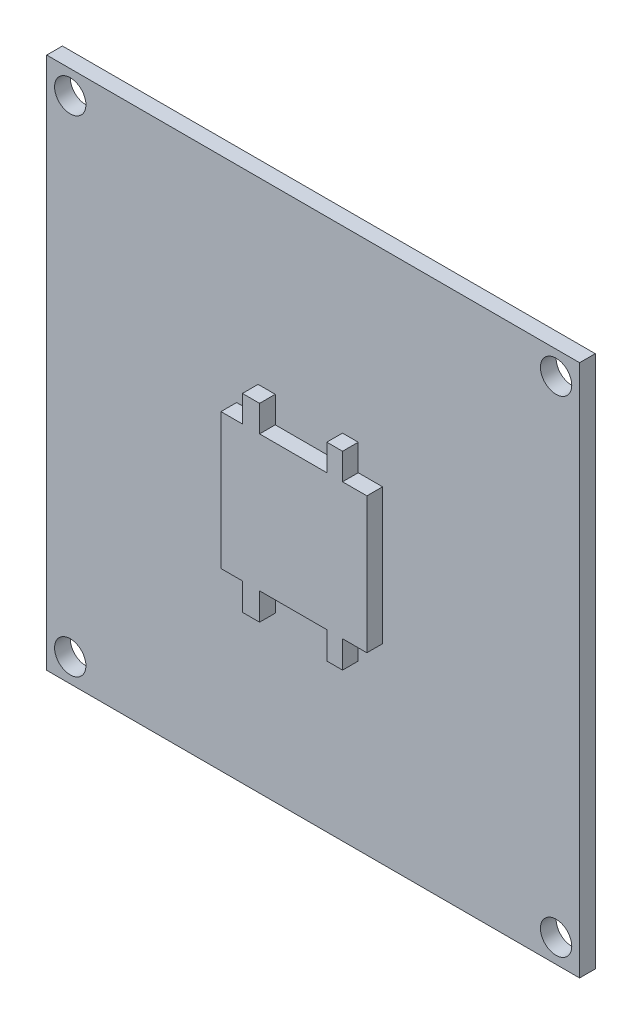
ISO-10303-21;
HEADER;
FILE_DESCRIPTION(('STEP AP214'),'2;1');
FILE_NAME('part.step','',(''),(''),'','','');
FILE_SCHEMA(('AUTOMOTIVE_DESIGN { 1 0 10303 214 1 1 1 1 }'));
ENDSEC;
DATA;
#1=APPLICATION_CONTEXT('core data for automotive mechanical design processes');
#2=APPLICATION_PROTOCOL_DEFINITION('international standard','automotive_design',2000,#1);
#3=PRODUCT_CONTEXT('',#1,'mechanical');
#4=PRODUCT('Part','Part','',(#3));
#5=PRODUCT_RELATED_PRODUCT_CATEGORY('part','',(#4));
#6=PRODUCT_DEFINITION_FORMATION('','',#4);
#7=PRODUCT_DEFINITION_CONTEXT('part definition',#1,'design');
#8=PRODUCT_DEFINITION('design','',#6,#7);
#9=PRODUCT_DEFINITION_SHAPE('','',#8);
#10=(LENGTH_UNIT() NAMED_UNIT(*) SI_UNIT(.MILLI.,.METRE.));
#11=(NAMED_UNIT(*) PLANE_ANGLE_UNIT() SI_UNIT($,.RADIAN.));
#12=(NAMED_UNIT(*) SI_UNIT($,.STERADIAN.) SOLID_ANGLE_UNIT());
#13=UNCERTAINTY_MEASURE_WITH_UNIT(LENGTH_MEASURE(1.E-05),#10,'distance_accuracy_value','');
#14=(GEOMETRIC_REPRESENTATION_CONTEXT(3) GLOBAL_UNCERTAINTY_ASSIGNED_CONTEXT((#13)) GLOBAL_UNIT_ASSIGNED_CONTEXT((#10,
#11,#12)) REPRESENTATION_CONTEXT('',''));
#15=CARTESIAN_POINT('',(0.,0.,0.));
#16=DIRECTION('',(0.,0.,1.));
#17=DIRECTION('',(1.,0.,0.));
#18=AXIS2_PLACEMENT_3D('',#15,#16,#17);
#19=CARTESIAN_POINT('',(0.,0.,1.));
#20=DIRECTION('',(0.,0.,-1.));
#21=DIRECTION('',(-1.,0.,0.));
#22=AXIS2_PLACEMENT_3D('',#19,#20,#21);
#23=PLANE('',#22);
#24=CARTESIAN_POINT('',(32.5,1.5,1.));
#25=DIRECTION('',(0.,0.,1.));
#26=DIRECTION('',(1.,0.,0.));
#27=AXIS2_PLACEMENT_3D('',#24,#25,#26);
#28=CIRCLE('',#27,0.999999999999998);
#29=CARTESIAN_POINT('',(33.5,1.5,1.));
#30=VERTEX_POINT('',#29);
#31=EDGE_CURVE('E238',#30,#30,#28,.T.);
#32=ORIENTED_EDGE('',*,*,#31,.F.);
#33=EDGE_LOOP('',(#32));
#34=FACE_BOUND('',#33,.T.);
#35=CARTESIAN_POINT('',(1.5,1.5,1.));
#36=DIRECTION('',(0.,0.,1.));
#37=DIRECTION('',(1.,0.,0.));
#38=AXIS2_PLACEMENT_3D('',#35,#36,#37);
#39=CIRCLE('',#38,1.);
#40=CARTESIAN_POINT('',(2.5,1.5,1.));
#41=VERTEX_POINT('',#40);
#42=EDGE_CURVE('E247',#41,#41,#39,.T.);
#43=ORIENTED_EDGE('',*,*,#42,.F.);
#44=EDGE_LOOP('',(#43));
#45=FACE_BOUND('',#44,.T.);
#46=CARTESIAN_POINT('',(32.5,32.5,1.));
#47=DIRECTION('',(0.,0.,1.));
#48=DIRECTION('',(1.,0.,0.));
#49=AXIS2_PLACEMENT_3D('',#46,#47,#48);
#50=CIRCLE('',#49,0.999999999999998);
#51=CARTESIAN_POINT('',(33.5,32.5,1.));
#52=VERTEX_POINT('',#51);
#53=EDGE_CURVE('E253',#52,#52,#50,.T.);
#54=ORIENTED_EDGE('',*,*,#53,.F.);
#55=EDGE_LOOP('',(#54));
#56=FACE_BOUND('',#55,.T.);
#57=CARTESIAN_POINT('',(1.5,32.5,1.));
#58=DIRECTION('',(0.,0.,1.));
#59=DIRECTION('',(1.,0.,0.));
#60=AXIS2_PLACEMENT_3D('',#57,#58,#59);
#61=CIRCLE('',#60,1.);
#62=CARTESIAN_POINT('',(2.5,32.5,1.));
#63=VERTEX_POINT('',#62);
#64=EDGE_CURVE('E259',#63,#63,#61,.T.);
#65=ORIENTED_EDGE('',*,*,#64,.F.);
#66=EDGE_LOOP('',(#65));
#67=FACE_BOUND('',#66,.T.);
#68=DIRECTION('',(0.,-1.,0.));
#69=VECTOR('',#68,1.);
#70=CARTESIAN_POINT('',(0.,0.,1.));
#71=LINE('',#70,#69);
#72=CARTESIAN_POINT('',(0.,34.,1.));
#73=VERTEX_POINT('',#72);
#74=CARTESIAN_POINT('',(0.,0.,1.));
#75=VERTEX_POINT('',#74);
#76=EDGE_CURVE('E265',#73,#75,#71,.T.);
#77=ORIENTED_EDGE('',*,*,#76,.T.);
#78=DIRECTION('',(1.,0.,0.));
#79=VECTOR('',#78,1.);
#80=CARTESIAN_POINT('',(0.,0.,1.));
#81=LINE('',#80,#79);
#82=CARTESIAN_POINT('',(34.,0.,1.));
#83=VERTEX_POINT('',#82);
#84=EDGE_CURVE('E89',#75,#83,#81,.T.);
#85=ORIENTED_EDGE('',*,*,#84,.T.);
#86=DIRECTION('',(0.,1.,0.));
#87=VECTOR('',#86,1.);
#88=CARTESIAN_POINT('',(34.,0.,1.));
#89=LINE('',#88,#87);
#90=CARTESIAN_POINT('',(34.,34.,1.));
#91=VERTEX_POINT('',#90);
#92=EDGE_CURVE('E268',#83,#91,#89,.T.);
#93=ORIENTED_EDGE('',*,*,#92,.T.);
#94=DIRECTION('',(-1.,0.,0.));
#95=VECTOR('',#94,1.);
#96=CARTESIAN_POINT('',(0.,34.,1.));
#97=LINE('',#96,#95);
#98=EDGE_CURVE('E61',#91,#73,#97,.T.);
#99=ORIENTED_EDGE('',*,*,#98,.T.);
#100=EDGE_LOOP('',(#77,#85,#93,#99));
#101=FACE_BOUND('',#100,.T.);
#102=DIRECTION('',(-1.,0.,0.));
#103=VECTOR('',#102,1.);
#104=CARTESIAN_POINT('',(0.,20.8566450376839,1.));
#105=LINE('',#104,#103);
#106=CARTESIAN_POINT('',(21.427154658643,20.8566450376839,1.));
#107=VERTEX_POINT('',#106);
#108=CARTESIAN_POINT('',(19.8753684896341,20.8566450376839,1.));
#109=VERTEX_POINT('',#108);
#110=EDGE_CURVE('E233',#107,#109,#105,.T.);
#111=ORIENTED_EDGE('',*,*,#110,.F.);
#112=DIRECTION('',(0.,-1.,0.));
#113=VECTOR('',#112,1.);
#114=CARTESIAN_POINT('',(21.427154658643,0.,1.));
#115=LINE('',#114,#113);
#116=CARTESIAN_POINT('',(21.427154658643,12.1848987991048,1.));
#117=VERTEX_POINT('',#116);
#118=EDGE_CURVE('E227',#107,#117,#115,.T.);
#119=ORIENTED_EDGE('',*,*,#118,.T.);
#120=DIRECTION('',(-1.,0.,0.));
#121=VECTOR('',#120,1.);
#122=CARTESIAN_POINT('',(0.,12.1848987991048,1.));
#123=LINE('',#122,#121);
#124=CARTESIAN_POINT('',(19.8753684896341,12.1848987991048,1.));
#125=VERTEX_POINT('',#124);
#126=EDGE_CURVE('E52',#117,#125,#123,.T.);
#127=ORIENTED_EDGE('',*,*,#126,.T.);
#128=DIRECTION('',(0.,-1.,0.));
#129=VECTOR('',#128,1.);
#130=CARTESIAN_POINT('',(19.8753684896341,0.,1.));
#131=LINE('',#130,#129);
#132=CARTESIAN_POINT('',(19.8753684896341,10.450549551389,1.));
#133=VERTEX_POINT('',#132);
#134=EDGE_CURVE('E685',#125,#133,#131,.T.);
#135=ORIENTED_EDGE('',*,*,#134,.T.);
#136=DIRECTION('',(1.,0.,0.));
#137=VECTOR('',#136,1.);
#138=CARTESIAN_POINT('',(0.,10.450549551389,1.));
#139=LINE('',#138,#137);
#140=CARTESIAN_POINT('',(18.871271556746,10.450549551389,1.));
#141=VERTEX_POINT('',#140);
#142=EDGE_CURVE('E682',#141,#133,#139,.T.);
#143=ORIENTED_EDGE('',*,*,#142,.F.);
#144=DIRECTION('',(0.,-1.,0.));
#145=VECTOR('',#144,1.);
#146=CARTESIAN_POINT('',(18.871271556746,0.,1.));
#147=LINE('',#146,#145);
#148=CARTESIAN_POINT('',(18.871271556746,12.1848987991048,1.));
#149=VERTEX_POINT('',#148);
#150=EDGE_CURVE('E680',#149,#141,#147,.T.);
#151=ORIENTED_EDGE('',*,*,#150,.F.);
#152=CARTESIAN_POINT('',(14.5810392071332,12.1848987991048,1.));
#153=VERTEX_POINT('',#152);
#154=EDGE_CURVE('E672',#149,#153,#123,.T.);
#155=ORIENTED_EDGE('',*,*,#154,.T.);
#156=DIRECTION('',(0.,-1.,0.));
#157=VECTOR('',#156,1.);
#158=CARTESIAN_POINT('',(14.5810392071332,0.,1.));
#159=LINE('',#158,#157);
#160=CARTESIAN_POINT('',(14.5810392071332,10.450549551389,1.));
#161=VERTEX_POINT('',#160);
#162=EDGE_CURVE('E677',#153,#161,#159,.T.);
#163=ORIENTED_EDGE('',*,*,#162,.T.);
#164=DIRECTION('',(1.,0.,0.));
#165=VECTOR('',#164,1.);
#166=CARTESIAN_POINT('',(0.,10.450549551389,1.));
#167=LINE('',#166,#165);
#168=CARTESIAN_POINT('',(13.4856607348916,10.450549551389,1.));
#169=VERTEX_POINT('',#168);
#170=EDGE_CURVE('E674',#169,#161,#167,.T.);
#171=ORIENTED_EDGE('',*,*,#170,.F.);
#172=DIRECTION('',(0.,-1.,0.));
#173=VECTOR('',#172,1.);
#174=CARTESIAN_POINT('',(13.4856607348916,0.,1.));
#175=LINE('',#174,#173);
#176=CARTESIAN_POINT('',(13.4856607348916,12.1848987991048,1.));
#177=VERTEX_POINT('',#176);
#178=EDGE_CURVE('E671',#177,#169,#175,.T.);
#179=ORIENTED_EDGE('',*,*,#178,.F.);
#180=CARTESIAN_POINT('',(12.1164376445897,12.1848987991048,1.));
#181=VERTEX_POINT('',#180);
#182=EDGE_CURVE('E668',#177,#181,#123,.T.);
#183=ORIENTED_EDGE('',*,*,#182,.T.);
#184=DIRECTION('',(0.,-1.,0.));
#185=VECTOR('',#184,1.);
#186=CARTESIAN_POINT('',(12.1164376445897,0.,1.));
#187=LINE('',#186,#185);
#188=CARTESIAN_POINT('',(12.1164376445897,20.8566450376839,1.));
#189=VERTEX_POINT('',#188);
#190=EDGE_CURVE('E665',#189,#181,#187,.T.);
#191=ORIENTED_EDGE('',*,*,#190,.F.);
#192=CARTESIAN_POINT('',(13.4856607348916,20.8566450376839,1.));
#193=VERTEX_POINT('',#192);
#194=EDGE_CURVE('E648',#193,#189,#105,.T.);
#195=ORIENTED_EDGE('',*,*,#194,.F.);
#196=DIRECTION('',(0.,1.,0.));
#197=VECTOR('',#196,1.);
#198=CARTESIAN_POINT('',(13.4856607348916,0.,1.));
#199=LINE('',#198,#197);
#200=CARTESIAN_POINT('',(13.4856607348916,22.5453535157229,1.));
#201=VERTEX_POINT('',#200);
#202=EDGE_CURVE('E659',#193,#201,#199,.T.);
#203=ORIENTED_EDGE('',*,*,#202,.T.);
#204=DIRECTION('',(1.,0.,0.));
#205=VECTOR('',#204,1.);
#206=CARTESIAN_POINT('',(0.,22.5453535157229,1.));
#207=LINE('',#206,#205);
#208=CARTESIAN_POINT('',(14.5810392071332,22.5453535157229,1.));
#209=VERTEX_POINT('',#208);
#210=EDGE_CURVE('E657',#201,#209,#207,.T.);
#211=ORIENTED_EDGE('',*,*,#210,.T.);
#212=DIRECTION('',(0.,1.,0.));
#213=VECTOR('',#212,1.);
#214=CARTESIAN_POINT('',(14.5810392071332,0.,1.));
#215=LINE('',#214,#213);
#216=CARTESIAN_POINT('',(14.5810392071332,20.8566450376839,1.));
#217=VERTEX_POINT('',#216);
#218=EDGE_CURVE('E645',#217,#209,#215,.T.);
#219=ORIENTED_EDGE('',*,*,#218,.F.);
#220=CARTESIAN_POINT('',(18.871271556746,20.8566450376839,1.));
#221=VERTEX_POINT('',#220);
#222=EDGE_CURVE('E635',#221,#217,#105,.T.);
#223=ORIENTED_EDGE('',*,*,#222,.F.);
#224=DIRECTION('',(0.,1.,0.));
#225=VECTOR('',#224,1.);
#226=CARTESIAN_POINT('',(18.871271556746,0.,1.));
#227=LINE('',#226,#225);
#228=CARTESIAN_POINT('',(18.871271556746,22.5453535157229,1.));
#229=VERTEX_POINT('',#228);
#230=EDGE_CURVE('E646',#221,#229,#227,.T.);
#231=ORIENTED_EDGE('',*,*,#230,.T.);
#232=DIRECTION('',(1.,0.,0.));
#233=VECTOR('',#232,1.);
#234=CARTESIAN_POINT('',(0.,22.5453535157229,1.));
#235=LINE('',#234,#233);
#236=CARTESIAN_POINT('',(19.8753684896341,22.5453535157229,1.));
#237=VERTEX_POINT('',#236);
#238=EDGE_CURVE('E727',#229,#237,#235,.T.);
#239=ORIENTED_EDGE('',*,*,#238,.T.);
#240=DIRECTION('',(0.,1.,0.));
#241=VECTOR('',#240,1.);
#242=CARTESIAN_POINT('',(19.8753684896341,0.,1.));
#243=LINE('',#242,#241);
#244=EDGE_CURVE('E728',#109,#237,#243,.T.);
#245=ORIENTED_EDGE('',*,*,#244,.F.);
#246=EDGE_LOOP('',(#111,#119,#127,#135,#143,#151,#155,#163,#171,#179,#183,#191,#195,#203,#211,
#219,#223,#231,#239,#245));
#247=FACE_BOUND('',#246,.T.);
#248=ADVANCED_FACE('F37',(#34,#45,#56,#67,#101,#247),#23,.F.);
#249=CARTESIAN_POINT('',(0.,0.,0.));
#250=DIRECTION('',(0.,0.,-1.));
#251=DIRECTION('',(-1.,0.,0.));
#252=AXIS2_PLACEMENT_3D('',#249,#250,#251);
#253=PLANE('',#252);
#254=CARTESIAN_POINT('',(1.5,1.5,0.));
#255=DIRECTION('',(0.,0.,1.));
#256=DIRECTION('',(1.,0.,0.));
#257=AXIS2_PLACEMENT_3D('',#254,#255,#256);
#258=CIRCLE('',#257,1.);
#259=CARTESIAN_POINT('',(2.5,1.5,0.));
#260=VERTEX_POINT('',#259);
#261=EDGE_CURVE('E245',#260,#260,#258,.T.);
#262=ORIENTED_EDGE('',*,*,#261,.T.);
#263=EDGE_LOOP('',(#262));
#264=FACE_BOUND('',#263,.T.);
#265=CARTESIAN_POINT('',(1.5,32.5,0.));
#266=DIRECTION('',(0.,0.,1.));
#267=DIRECTION('',(1.,0.,0.));
#268=AXIS2_PLACEMENT_3D('',#265,#266,#267);
#269=CIRCLE('',#268,1.);
#270=CARTESIAN_POINT('',(2.5,32.5,0.));
#271=VERTEX_POINT('',#270);
#272=EDGE_CURVE('E256',#271,#271,#269,.T.);
#273=ORIENTED_EDGE('',*,*,#272,.T.);
#274=EDGE_LOOP('',(#273));
#275=FACE_BOUND('',#274,.T.);
#276=DIRECTION('',(0.,-1.,0.));
#277=VECTOR('',#276,1.);
#278=CARTESIAN_POINT('',(0.,0.,0.));
#279=LINE('',#278,#277);
#280=CARTESIAN_POINT('',(0.,34.,0.));
#281=VERTEX_POINT('',#280);
#282=CARTESIAN_POINT('',(0.,0.,0.));
#283=VERTEX_POINT('',#282);
#284=EDGE_CURVE('E262',#281,#283,#279,.T.);
#285=ORIENTED_EDGE('',*,*,#284,.F.);
#286=DIRECTION('',(-1.,0.,0.));
#287=VECTOR('',#286,1.);
#288=CARTESIAN_POINT('',(0.,34.,0.));
#289=LINE('',#288,#287);
#290=CARTESIAN_POINT('',(34.,34.,0.));
#291=VERTEX_POINT('',#290);
#292=EDGE_CURVE('E82',#291,#281,#289,.T.);
#293=ORIENTED_EDGE('',*,*,#292,.F.);
#294=DIRECTION('',(0.,1.,0.));
#295=VECTOR('',#294,1.);
#296=CARTESIAN_POINT('',(34.,0.,0.));
#297=LINE('',#296,#295);
#298=CARTESIAN_POINT('',(34.,0.,0.));
#299=VERTEX_POINT('',#298);
#300=EDGE_CURVE('E276',#299,#291,#297,.T.);
#301=ORIENTED_EDGE('',*,*,#300,.F.);
#302=DIRECTION('',(1.,0.,0.));
#303=VECTOR('',#302,1.);
#304=CARTESIAN_POINT('',(0.,0.,0.));
#305=LINE('',#304,#303);
#306=EDGE_CURVE('E274',#283,#299,#305,.T.);
#307=ORIENTED_EDGE('',*,*,#306,.F.);
#308=EDGE_LOOP('',(#285,#293,#301,#307));
#309=FACE_BOUND('',#308,.T.);
#310=CARTESIAN_POINT('',(32.5,32.5,0.));
#311=DIRECTION('',(0.,0.,1.));
#312=DIRECTION('',(1.,0.,0.));
#313=AXIS2_PLACEMENT_3D('',#310,#311,#312);
#314=CIRCLE('',#313,0.999999999999998);
#315=CARTESIAN_POINT('',(33.5,32.5,0.));
#316=VERTEX_POINT('',#315);
#317=EDGE_CURVE('E250',#316,#316,#314,.T.);
#318=ORIENTED_EDGE('',*,*,#317,.T.);
#319=EDGE_LOOP('',(#318));
#320=FACE_BOUND('',#319,.T.);
#321=CARTESIAN_POINT('',(32.5,1.5,0.));
#322=DIRECTION('',(0.,0.,1.));
#323=DIRECTION('',(1.,0.,0.));
#324=AXIS2_PLACEMENT_3D('',#321,#322,#323);
#325=CIRCLE('',#324,0.999999999999998);
#326=CARTESIAN_POINT('',(33.5,1.5,0.));
#327=VERTEX_POINT('',#326);
#328=EDGE_CURVE('E235',#327,#327,#325,.T.);
#329=ORIENTED_EDGE('',*,*,#328,.T.);
#330=EDGE_LOOP('',(#329));
#331=FACE_BOUND('',#330,.T.);
#332=ADVANCED_FACE('F289',(#264,#275,#309,#320,#331),#253,.T.);
#333=CARTESIAN_POINT('',(0.,0.,1.));
#334=DIRECTION('',(1.,0.,0.));
#335=DIRECTION('',(0.,0.,-1.));
#336=AXIS2_PLACEMENT_3D('',#333,#334,#335);
#337=PLANE('',#336);
#338=ORIENTED_EDGE('',*,*,#284,.T.);
#339=DIRECTION('',(0.,0.,-1.));
#340=VECTOR('',#339,1.);
#341=CARTESIAN_POINT('',(0.,0.,1.));
#342=LINE('',#341,#340);
#343=EDGE_CURVE('E11',#75,#283,#342,.T.);
#344=ORIENTED_EDGE('',*,*,#343,.F.);
#345=ORIENTED_EDGE('',*,*,#76,.F.);
#346=DIRECTION('',(0.,0.,-1.));
#347=VECTOR('',#346,1.);
#348=CARTESIAN_POINT('',(0.,34.,1.));
#349=LINE('',#348,#347);
#350=EDGE_CURVE('E271',#73,#281,#349,.T.);
#351=ORIENTED_EDGE('',*,*,#350,.T.);
#352=EDGE_LOOP('',(#338,#344,#345,#351));
#353=FACE_BOUND('',#352,.T.);
#354=ADVANCED_FACE('F39',(#353),#337,.F.);
#355=CARTESIAN_POINT('',(0.,0.,1.));
#356=DIRECTION('',(0.,1.,0.));
#357=DIRECTION('',(0.,0.,1.));
#358=AXIS2_PLACEMENT_3D('',#355,#356,#357);
#359=PLANE('',#358);
#360=ORIENTED_EDGE('',*,*,#306,.T.);
#361=DIRECTION('',(0.,0.,-1.));
#362=VECTOR('',#361,1.);
#363=CARTESIAN_POINT('',(34.,0.,1.));
#364=LINE('',#363,#362);
#365=EDGE_CURVE('E45',#83,#299,#364,.T.);
#366=ORIENTED_EDGE('',*,*,#365,.F.);
#367=ORIENTED_EDGE('',*,*,#84,.F.);
#368=ORIENTED_EDGE('',*,*,#343,.T.);
#369=EDGE_LOOP('',(#360,#366,#367,#368));
#370=FACE_BOUND('',#369,.T.);
#371=ADVANCED_FACE('F305',(#370),#359,.F.);
#372=CARTESIAN_POINT('',(34.,0.,1.));
#373=DIRECTION('',(-1.,0.,0.));
#374=DIRECTION('',(0.,0.,1.));
#375=AXIS2_PLACEMENT_3D('',#372,#373,#374);
#376=PLANE('',#375);
#377=ORIENTED_EDGE('',*,*,#300,.T.);
#378=DIRECTION('',(0.,0.,-1.));
#379=VECTOR('',#378,1.);
#380=CARTESIAN_POINT('',(34.,34.,1.));
#381=LINE('',#380,#379);
#382=EDGE_CURVE('E280',#91,#291,#381,.T.);
#383=ORIENTED_EDGE('',*,*,#382,.F.);
#384=ORIENTED_EDGE('',*,*,#92,.F.);
#385=ORIENTED_EDGE('',*,*,#365,.T.);
#386=EDGE_LOOP('',(#377,#383,#384,#385));
#387=FACE_BOUND('',#386,.T.);
#388=ADVANCED_FACE('F285',(#387),#376,.F.);
#389=CARTESIAN_POINT('',(0.,34.,1.));
#390=DIRECTION('',(0.,-1.,0.));
#391=DIRECTION('',(0.,0.,-1.));
#392=AXIS2_PLACEMENT_3D('',#389,#390,#391);
#393=PLANE('',#392);
#394=ORIENTED_EDGE('',*,*,#292,.T.);
#395=ORIENTED_EDGE('',*,*,#350,.F.);
#396=ORIENTED_EDGE('',*,*,#98,.F.);
#397=ORIENTED_EDGE('',*,*,#382,.T.);
#398=EDGE_LOOP('',(#394,#395,#396,#397));
#399=FACE_BOUND('',#398,.T.);
#400=ADVANCED_FACE('F294',(#399),#393,.F.);
#401=CARTESIAN_POINT('',(1.5,32.5,1.));
#402=DIRECTION('',(0.,0.,-1.));
#403=DIRECTION('',(-1.,0.,0.));
#404=AXIS2_PLACEMENT_3D('',#401,#402,#403);
#405=CYLINDRICAL_SURFACE('',#404,1.);
#406=ORIENTED_EDGE('',*,*,#64,.T.);
#407=EDGE_LOOP('',(#406));
#408=FACE_BOUND('',#407,.T.);
#409=ORIENTED_EDGE('',*,*,#272,.F.);
#410=EDGE_LOOP('',(#409));
#411=FACE_BOUND('',#410,.T.);
#412=ADVANCED_FACE('F296',(#408,#411),#405,.F.);
#413=CARTESIAN_POINT('',(32.5,32.5,1.));
#414=DIRECTION('',(0.,0.,-1.));
#415=DIRECTION('',(-1.,0.,0.));
#416=AXIS2_PLACEMENT_3D('',#413,#414,#415);
#417=CYLINDRICAL_SURFACE('',#416,0.999999999999998);
#418=ORIENTED_EDGE('',*,*,#53,.T.);
#419=EDGE_LOOP('',(#418));
#420=FACE_BOUND('',#419,.T.);
#421=ORIENTED_EDGE('',*,*,#317,.F.);
#422=EDGE_LOOP('',(#421));
#423=FACE_BOUND('',#422,.T.);
#424=ADVANCED_FACE('F302',(#420,#423),#417,.F.);
#425=CARTESIAN_POINT('',(1.5,1.5,1.));
#426=DIRECTION('',(0.,0.,-1.));
#427=DIRECTION('',(-1.,0.,0.));
#428=AXIS2_PLACEMENT_3D('',#425,#426,#427);
#429=CYLINDRICAL_SURFACE('',#428,1.);
#430=ORIENTED_EDGE('',*,*,#42,.T.);
#431=EDGE_LOOP('',(#430));
#432=FACE_BOUND('',#431,.T.);
#433=ORIENTED_EDGE('',*,*,#261,.F.);
#434=EDGE_LOOP('',(#433));
#435=FACE_BOUND('',#434,.T.);
#436=ADVANCED_FACE('F320',(#432,#435),#429,.F.);
#437=CARTESIAN_POINT('',(32.5,1.5,1.));
#438=DIRECTION('',(0.,0.,-1.));
#439=DIRECTION('',(-1.,0.,0.));
#440=AXIS2_PLACEMENT_3D('',#437,#438,#439);
#441=CYLINDRICAL_SURFACE('',#440,0.999999999999998);
#442=ORIENTED_EDGE('',*,*,#31,.T.);
#443=EDGE_LOOP('',(#442));
#444=FACE_BOUND('',#443,.T.);
#445=ORIENTED_EDGE('',*,*,#328,.F.);
#446=EDGE_LOOP('',(#445));
#447=FACE_BOUND('',#446,.T.);
#448=ADVANCED_FACE('F324',(#444,#447),#441,.F.);
#449=CARTESIAN_POINT('',(0.,20.8566450376839,2.));
#450=DIRECTION('',(0.,-1.,0.));
#451=DIRECTION('',(0.,0.,-1.));
#452=AXIS2_PLACEMENT_3D('',#449,#450,#451);
#453=PLANE('',#452);
#454=ORIENTED_EDGE('',*,*,#110,.T.);
#455=DIRECTION('',(0.,0.,-1.));
#456=VECTOR('',#455,1.);
#457=CARTESIAN_POINT('',(19.8753684896341,20.8566450376839,2.));
#458=LINE('',#457,#456);
#459=CARTESIAN_POINT('',(19.8753684896341,20.8566450376839,2.));
#460=VERTEX_POINT('',#459);
#461=EDGE_CURVE('E211',#460,#109,#458,.T.);
#462=ORIENTED_EDGE('',*,*,#461,.F.);
#463=DIRECTION('',(-1.,0.,0.));
#464=VECTOR('',#463,1.);
#465=CARTESIAN_POINT('',(0.,20.8566450376839,2.));
#466=LINE('',#465,#464);
#467=CARTESIAN_POINT('',(21.427154658643,20.8566450376839,2.));
#468=VERTEX_POINT('',#467);
#469=EDGE_CURVE('E218',#468,#460,#466,.T.);
#470=ORIENTED_EDGE('',*,*,#469,.F.);
#471=DIRECTION('',(0.,0.,-1.));
#472=VECTOR('',#471,1.);
#473=CARTESIAN_POINT('',(21.427154658643,20.8566450376839,2.));
#474=LINE('',#473,#472);
#475=EDGE_CURVE('E690',#468,#107,#474,.T.);
#476=ORIENTED_EDGE('',*,*,#475,.T.);
#477=EDGE_LOOP('',(#454,#462,#470,#476));
#478=FACE_BOUND('',#477,.T.);
#479=ADVANCED_FACE('F231',(#478),#453,.F.);
#480=CARTESIAN_POINT('',(19.8753684896341,0.,2.));
#481=DIRECTION('',(-1.,0.,0.));
#482=DIRECTION('',(0.,0.,1.));
#483=AXIS2_PLACEMENT_3D('',#480,#481,#482);
#484=PLANE('',#483);
#485=ORIENTED_EDGE('',*,*,#244,.T.);
#486=DIRECTION('',(0.,0.,-1.));
#487=VECTOR('',#486,1.);
#488=CARTESIAN_POINT('',(19.8753684896341,22.5453535157229,2.));
#489=LINE('',#488,#487);
#490=CARTESIAN_POINT('',(19.8753684896341,22.5453535157229,2.));
#491=VERTEX_POINT('',#490);
#492=EDGE_CURVE('E213',#491,#237,#489,.T.);
#493=ORIENTED_EDGE('',*,*,#492,.F.);
#494=DIRECTION('',(0.,1.,0.));
#495=VECTOR('',#494,1.);
#496=CARTESIAN_POINT('',(19.8753684896341,0.,2.));
#497=LINE('',#496,#495);
#498=EDGE_CURVE('E206',#460,#491,#497,.T.);
#499=ORIENTED_EDGE('',*,*,#498,.F.);
#500=ORIENTED_EDGE('',*,*,#461,.T.);
#501=EDGE_LOOP('',(#485,#493,#499,#500));
#502=FACE_BOUND('',#501,.T.);
#503=ADVANCED_FACE('F209',(#502),#484,.F.);
#504=CARTESIAN_POINT('',(0.,22.5453535157229,2.));
#505=DIRECTION('',(0.,1.,0.));
#506=DIRECTION('',(0.,0.,1.));
#507=AXIS2_PLACEMENT_3D('',#504,#505,#506);
#508=PLANE('',#507);
#509=ORIENTED_EDGE('',*,*,#238,.F.);
#510=DIRECTION('',(0.,0.,-1.));
#511=VECTOR('',#510,1.);
#512=CARTESIAN_POINT('',(18.871271556746,22.5453535157229,2.));
#513=LINE('',#512,#511);
#514=CARTESIAN_POINT('',(18.871271556746,22.5453535157229,2.));
#515=VERTEX_POINT('',#514);
#516=EDGE_CURVE('E240',#515,#229,#513,.T.);
#517=ORIENTED_EDGE('',*,*,#516,.F.);
#518=DIRECTION('',(1.,0.,0.));
#519=VECTOR('',#518,1.);
#520=CARTESIAN_POINT('',(0.,22.5453535157229,2.));
#521=LINE('',#520,#519);
#522=EDGE_CURVE('E217',#515,#491,#521,.T.);
#523=ORIENTED_EDGE('',*,*,#522,.T.);
#524=ORIENTED_EDGE('',*,*,#492,.T.);
#525=EDGE_LOOP('',(#509,#517,#523,#524));
#526=FACE_BOUND('',#525,.T.);
#527=ADVANCED_FACE('F331',(#526),#508,.T.);
#528=CARTESIAN_POINT('',(18.871271556746,0.,2.));
#529=DIRECTION('',(-1.,0.,0.));
#530=DIRECTION('',(0.,0.,1.));
#531=AXIS2_PLACEMENT_3D('',#528,#529,#530);
#532=PLANE('',#531);
#533=ORIENTED_EDGE('',*,*,#230,.F.);
#534=DIRECTION('',(0.,0.,-1.));
#535=VECTOR('',#534,1.);
#536=CARTESIAN_POINT('',(18.871271556746,20.8566450376839,2.));
#537=LINE('',#536,#535);
#538=CARTESIAN_POINT('',(18.871271556746,20.8566450376839,2.));
#539=VERTEX_POINT('',#538);
#540=EDGE_CURVE('E640',#539,#221,#537,.T.);
#541=ORIENTED_EDGE('',*,*,#540,.F.);
#542=DIRECTION('',(0.,1.,0.));
#543=VECTOR('',#542,1.);
#544=CARTESIAN_POINT('',(18.871271556746,0.,2.));
#545=LINE('',#544,#543);
#546=EDGE_CURVE('E725',#539,#515,#545,.T.);
#547=ORIENTED_EDGE('',*,*,#546,.T.);
#548=ORIENTED_EDGE('',*,*,#516,.T.);
#549=EDGE_LOOP('',(#533,#541,#547,#548));
#550=FACE_BOUND('',#549,.T.);
#551=ADVANCED_FACE('F334',(#550),#532,.T.);
#552=ORIENTED_EDGE('',*,*,#222,.T.);
#553=DIRECTION('',(0.,0.,-1.));
#554=VECTOR('',#553,1.);
#555=CARTESIAN_POINT('',(14.5810392071332,20.8566450376839,2.));
#556=LINE('',#555,#554);
#557=CARTESIAN_POINT('',(14.5810392071332,20.8566450376839,2.));
#558=VERTEX_POINT('',#557);
#559=EDGE_CURVE('E638',#558,#217,#556,.T.);
#560=ORIENTED_EDGE('',*,*,#559,.F.);
#561=EDGE_CURVE('E230',#539,#558,#466,.T.);
#562=ORIENTED_EDGE('',*,*,#561,.F.);
#563=ORIENTED_EDGE('',*,*,#540,.T.);
#564=EDGE_LOOP('',(#552,#560,#562,#563));
#565=FACE_BOUND('',#564,.T.);
#566=ADVANCED_FACE('F338',(#565),#453,.F.);
#567=CARTESIAN_POINT('',(14.5810392071332,0.,2.));
#568=DIRECTION('',(-1.,0.,0.));
#569=DIRECTION('',(0.,0.,1.));
#570=AXIS2_PLACEMENT_3D('',#567,#568,#569);
#571=PLANE('',#570);
#572=ORIENTED_EDGE('',*,*,#218,.T.);
#573=DIRECTION('',(0.,0.,-1.));
#574=VECTOR('',#573,1.);
#575=CARTESIAN_POINT('',(14.5810392071332,22.5453535157229,2.));
#576=LINE('',#575,#574);
#577=CARTESIAN_POINT('',(14.5810392071332,22.5453535157229,2.));
#578=VERTEX_POINT('',#577);
#579=EDGE_CURVE('E653',#578,#209,#576,.T.);
#580=ORIENTED_EDGE('',*,*,#579,.F.);
#581=DIRECTION('',(0.,1.,0.));
#582=VECTOR('',#581,1.);
#583=CARTESIAN_POINT('',(14.5810392071332,0.,2.));
#584=LINE('',#583,#582);
#585=EDGE_CURVE('E652',#558,#578,#584,.T.);
#586=ORIENTED_EDGE('',*,*,#585,.F.);
#587=ORIENTED_EDGE('',*,*,#559,.T.);
#588=EDGE_LOOP('',(#572,#580,#586,#587));
#589=FACE_BOUND('',#588,.T.);
#590=ADVANCED_FACE('F340',(#589),#571,.F.);
#591=CARTESIAN_POINT('',(0.,22.5453535157229,2.));
#592=DIRECTION('',(0.,1.,0.));
#593=DIRECTION('',(0.,0.,1.));
#594=AXIS2_PLACEMENT_3D('',#591,#592,#593);
#595=PLANE('',#594);
#596=ORIENTED_EDGE('',*,*,#210,.F.);
#597=DIRECTION('',(0.,0.,-1.));
#598=VECTOR('',#597,1.);
#599=CARTESIAN_POINT('',(13.4856607348916,22.5453535157229,2.));
#600=LINE('',#599,#598);
#601=CARTESIAN_POINT('',(13.4856607348916,22.5453535157229,2.));
#602=VERTEX_POINT('',#601);
#603=EDGE_CURVE('E719',#602,#201,#600,.T.);
#604=ORIENTED_EDGE('',*,*,#603,.F.);
#605=DIRECTION('',(1.,0.,0.));
#606=VECTOR('',#605,1.);
#607=CARTESIAN_POINT('',(0.,22.5453535157229,2.));
#608=LINE('',#607,#606);
#609=EDGE_CURVE('E756',#602,#578,#608,.T.);
#610=ORIENTED_EDGE('',*,*,#609,.T.);
#611=ORIENTED_EDGE('',*,*,#579,.T.);
#612=EDGE_LOOP('',(#596,#604,#610,#611));
#613=FACE_BOUND('',#612,.T.);
#614=ADVANCED_FACE('F343',(#613),#595,.T.);
#615=CARTESIAN_POINT('',(13.4856607348916,0.,2.));
#616=DIRECTION('',(-1.,0.,0.));
#617=DIRECTION('',(0.,0.,1.));
#618=AXIS2_PLACEMENT_3D('',#615,#616,#617);
#619=PLANE('',#618);
#620=ORIENTED_EDGE('',*,*,#202,.F.);
#621=DIRECTION('',(0.,0.,-1.));
#622=VECTOR('',#621,1.);
#623=CARTESIAN_POINT('',(13.4856607348916,20.8566450376839,2.));
#624=LINE('',#623,#622);
#625=CARTESIAN_POINT('',(13.4856607348916,20.8566450376839,2.));
#626=VERTEX_POINT('',#625);
#627=EDGE_CURVE('E717',#626,#193,#624,.T.);
#628=ORIENTED_EDGE('',*,*,#627,.F.);
#629=DIRECTION('',(0.,1.,0.));
#630=VECTOR('',#629,1.);
#631=CARTESIAN_POINT('',(13.4856607348916,0.,2.));
#632=LINE('',#631,#630);
#633=EDGE_CURVE('E753',#626,#602,#632,.T.);
#634=ORIENTED_EDGE('',*,*,#633,.T.);
#635=ORIENTED_EDGE('',*,*,#603,.T.);
#636=EDGE_LOOP('',(#620,#628,#634,#635));
#637=FACE_BOUND('',#636,.T.);
#638=ADVANCED_FACE('F347',(#637),#619,.T.);
#639=ORIENTED_EDGE('',*,*,#194,.T.);
#640=DIRECTION('',(0.,0.,-1.));
#641=VECTOR('',#640,1.);
#642=CARTESIAN_POINT('',(12.1164376445897,20.8566450376839,2.));
#643=LINE('',#642,#641);
#644=CARTESIAN_POINT('',(12.1164376445897,20.8566450376839,2.));
#645=VERTEX_POINT('',#644);
#646=EDGE_CURVE('E714',#645,#189,#643,.T.);
#647=ORIENTED_EDGE('',*,*,#646,.F.);
#648=EDGE_CURVE('E229',#626,#645,#466,.T.);
#649=ORIENTED_EDGE('',*,*,#648,.F.);
#650=ORIENTED_EDGE('',*,*,#627,.T.);
#651=EDGE_LOOP('',(#639,#647,#649,#650));
#652=FACE_BOUND('',#651,.T.);
#653=ADVANCED_FACE('F351',(#652),#453,.F.);
#654=CARTESIAN_POINT('',(12.1164376445897,0.,2.));
#655=DIRECTION('',(1.,0.,0.));
#656=DIRECTION('',(0.,0.,-1.));
#657=AXIS2_PLACEMENT_3D('',#654,#655,#656);
#658=PLANE('',#657);
#659=ORIENTED_EDGE('',*,*,#190,.T.);
#660=DIRECTION('',(0.,0.,-1.));
#661=VECTOR('',#660,1.);
#662=CARTESIAN_POINT('',(12.1164376445897,12.1848987991048,2.));
#663=LINE('',#662,#661);
#664=CARTESIAN_POINT('',(12.1164376445897,12.1848987991048,2.));
#665=VERTEX_POINT('',#664);
#666=EDGE_CURVE('E712',#665,#181,#663,.T.);
#667=ORIENTED_EDGE('',*,*,#666,.F.);
#668=DIRECTION('',(0.,-1.,0.));
#669=VECTOR('',#668,1.);
#670=CARTESIAN_POINT('',(12.1164376445897,0.,2.));
#671=LINE('',#670,#669);
#672=EDGE_CURVE('E751',#645,#665,#671,.T.);
#673=ORIENTED_EDGE('',*,*,#672,.F.);
#674=ORIENTED_EDGE('',*,*,#646,.T.);
#675=EDGE_LOOP('',(#659,#667,#673,#674));
#676=FACE_BOUND('',#675,.T.);
#677=ADVANCED_FACE('F355',(#676),#658,.F.);
#678=CARTESIAN_POINT('',(0.,12.1848987991048,2.));
#679=DIRECTION('',(0.,-1.,0.));
#680=DIRECTION('',(0.,0.,-1.));
#681=AXIS2_PLACEMENT_3D('',#678,#679,#680);
#682=PLANE('',#681);
#683=ORIENTED_EDGE('',*,*,#182,.F.);
#684=DIRECTION('',(0.,0.,-1.));
#685=VECTOR('',#684,1.);
#686=CARTESIAN_POINT('',(13.4856607348916,12.1848987991048,2.));
#687=LINE('',#686,#685);
#688=CARTESIAN_POINT('',(13.4856607348916,12.1848987991048,2.));
#689=VERTEX_POINT('',#688);
#690=EDGE_CURVE('E710',#689,#177,#687,.T.);
#691=ORIENTED_EDGE('',*,*,#690,.F.);
#692=DIRECTION('',(-1.,0.,0.));
#693=VECTOR('',#692,1.);
#694=CARTESIAN_POINT('',(0.,12.1848987991048,2.));
#695=LINE('',#694,#693);
#696=EDGE_CURVE('E748',#689,#665,#695,.T.);
#697=ORIENTED_EDGE('',*,*,#696,.T.);
#698=ORIENTED_EDGE('',*,*,#666,.T.);
#699=EDGE_LOOP('',(#683,#691,#697,#698));
#700=FACE_BOUND('',#699,.T.);
#701=ADVANCED_FACE('F359',(#700),#682,.T.);
#702=CARTESIAN_POINT('',(13.4856607348916,0.,2.));
#703=DIRECTION('',(1.,0.,0.));
#704=DIRECTION('',(0.,0.,-1.));
#705=AXIS2_PLACEMENT_3D('',#702,#703,#704);
#706=PLANE('',#705);
#707=ORIENTED_EDGE('',*,*,#178,.T.);
#708=DIRECTION('',(0.,0.,-1.));
#709=VECTOR('',#708,1.);
#710=CARTESIAN_POINT('',(13.4856607348916,10.450549551389,2.));
#711=LINE('',#710,#709);
#712=CARTESIAN_POINT('',(13.4856607348916,10.450549551389,2.));
#713=VERTEX_POINT('',#712);
#714=EDGE_CURVE('E707',#713,#169,#711,.T.);
#715=ORIENTED_EDGE('',*,*,#714,.F.);
#716=DIRECTION('',(0.,-1.,0.));
#717=VECTOR('',#716,1.);
#718=CARTESIAN_POINT('',(13.4856607348916,0.,2.));
#719=LINE('',#718,#717);
#720=EDGE_CURVE('E746',#689,#713,#719,.T.);
#721=ORIENTED_EDGE('',*,*,#720,.F.);
#722=ORIENTED_EDGE('',*,*,#690,.T.);
#723=EDGE_LOOP('',(#707,#715,#721,#722));
#724=FACE_BOUND('',#723,.T.);
#725=ADVANCED_FACE('F361',(#724),#706,.F.);
#726=CARTESIAN_POINT('',(0.,10.450549551389,2.));
#727=DIRECTION('',(0.,1.,0.));
#728=DIRECTION('',(0.,0.,1.));
#729=AXIS2_PLACEMENT_3D('',#726,#727,#728);
#730=PLANE('',#729);
#731=ORIENTED_EDGE('',*,*,#170,.T.);
#732=DIRECTION('',(0.,0.,-1.));
#733=VECTOR('',#732,1.);
#734=CARTESIAN_POINT('',(14.5810392071332,10.450549551389,2.));
#735=LINE('',#734,#733);
#736=CARTESIAN_POINT('',(14.5810392071332,10.450549551389,2.));
#737=VERTEX_POINT('',#736);
#738=EDGE_CURVE('E705',#737,#161,#735,.T.);
#739=ORIENTED_EDGE('',*,*,#738,.F.);
#740=DIRECTION('',(1.,0.,0.));
#741=VECTOR('',#740,1.);
#742=CARTESIAN_POINT('',(0.,10.450549551389,2.));
#743=LINE('',#742,#741);
#744=EDGE_CURVE('E744',#713,#737,#743,.T.);
#745=ORIENTED_EDGE('',*,*,#744,.F.);
#746=ORIENTED_EDGE('',*,*,#714,.T.);
#747=EDGE_LOOP('',(#731,#739,#745,#746));
#748=FACE_BOUND('',#747,.T.);
#749=ADVANCED_FACE('F364',(#748),#730,.F.);
#750=CARTESIAN_POINT('',(14.5810392071332,0.,2.));
#751=DIRECTION('',(1.,0.,0.));
#752=DIRECTION('',(0.,0.,-1.));
#753=AXIS2_PLACEMENT_3D('',#750,#751,#752);
#754=PLANE('',#753);
#755=ORIENTED_EDGE('',*,*,#162,.F.);
#756=DIRECTION('',(0.,0.,-1.));
#757=VECTOR('',#756,1.);
#758=CARTESIAN_POINT('',(14.5810392071332,12.1848987991048,2.));
#759=LINE('',#758,#757);
#760=CARTESIAN_POINT('',(14.5810392071332,12.1848987991048,2.));
#761=VERTEX_POINT('',#760);
#762=EDGE_CURVE('E703',#761,#153,#759,.T.);
#763=ORIENTED_EDGE('',*,*,#762,.F.);
#764=DIRECTION('',(0.,-1.,0.));
#765=VECTOR('',#764,1.);
#766=CARTESIAN_POINT('',(14.5810392071332,0.,2.));
#767=LINE('',#766,#765);
#768=EDGE_CURVE('E741',#761,#737,#767,.T.);
#769=ORIENTED_EDGE('',*,*,#768,.T.);
#770=ORIENTED_EDGE('',*,*,#738,.T.);
#771=EDGE_LOOP('',(#755,#763,#769,#770));
#772=FACE_BOUND('',#771,.T.);
#773=ADVANCED_FACE('F368',(#772),#754,.T.);
#774=ORIENTED_EDGE('',*,*,#154,.F.);
#775=DIRECTION('',(0.,0.,-1.));
#776=VECTOR('',#775,1.);
#777=CARTESIAN_POINT('',(18.871271556746,12.1848987991048,2.));
#778=LINE('',#777,#776);
#779=CARTESIAN_POINT('',(18.871271556746,12.1848987991048,2.));
#780=VERTEX_POINT('',#779);
#781=EDGE_CURVE('E701',#780,#149,#778,.T.);
#782=ORIENTED_EDGE('',*,*,#781,.F.);
#783=EDGE_CURVE('E740',#780,#761,#695,.T.);
#784=ORIENTED_EDGE('',*,*,#783,.T.);
#785=ORIENTED_EDGE('',*,*,#762,.T.);
#786=EDGE_LOOP('',(#774,#782,#784,#785));
#787=FACE_BOUND('',#786,.T.);
#788=ADVANCED_FACE('F372',(#787),#682,.T.);
#789=CARTESIAN_POINT('',(18.871271556746,0.,2.));
#790=DIRECTION('',(1.,0.,0.));
#791=DIRECTION('',(0.,0.,-1.));
#792=AXIS2_PLACEMENT_3D('',#789,#790,#791);
#793=PLANE('',#792);
#794=ORIENTED_EDGE('',*,*,#150,.T.);
#795=DIRECTION('',(0.,0.,-1.));
#796=VECTOR('',#795,1.);
#797=CARTESIAN_POINT('',(18.871271556746,10.450549551389,2.));
#798=LINE('',#797,#796);
#799=CARTESIAN_POINT('',(18.871271556746,10.450549551389,2.));
#800=VERTEX_POINT('',#799);
#801=EDGE_CURVE('E698',#800,#141,#798,.T.);
#802=ORIENTED_EDGE('',*,*,#801,.F.);
#803=DIRECTION('',(0.,-1.,0.));
#804=VECTOR('',#803,1.);
#805=CARTESIAN_POINT('',(18.871271556746,0.,2.));
#806=LINE('',#805,#804);
#807=EDGE_CURVE('E738',#780,#800,#806,.T.);
#808=ORIENTED_EDGE('',*,*,#807,.F.);
#809=ORIENTED_EDGE('',*,*,#781,.T.);
#810=EDGE_LOOP('',(#794,#802,#808,#809));
#811=FACE_BOUND('',#810,.T.);
#812=ADVANCED_FACE('F374',(#811),#793,.F.);
#813=CARTESIAN_POINT('',(0.,10.450549551389,2.));
#814=DIRECTION('',(0.,1.,0.));
#815=DIRECTION('',(0.,0.,1.));
#816=AXIS2_PLACEMENT_3D('',#813,#814,#815);
#817=PLANE('',#816);
#818=ORIENTED_EDGE('',*,*,#142,.T.);
#819=DIRECTION('',(0.,0.,-1.));
#820=VECTOR('',#819,1.);
#821=CARTESIAN_POINT('',(19.8753684896341,10.450549551389,2.));
#822=LINE('',#821,#820);
#823=CARTESIAN_POINT('',(19.8753684896341,10.450549551389,2.));
#824=VERTEX_POINT('',#823);
#825=EDGE_CURVE('E696',#824,#133,#822,.T.);
#826=ORIENTED_EDGE('',*,*,#825,.F.);
#827=DIRECTION('',(1.,0.,0.));
#828=VECTOR('',#827,1.);
#829=CARTESIAN_POINT('',(0.,10.450549551389,2.));
#830=LINE('',#829,#828);
#831=EDGE_CURVE('E736',#800,#824,#830,.T.);
#832=ORIENTED_EDGE('',*,*,#831,.F.);
#833=ORIENTED_EDGE('',*,*,#801,.T.);
#834=EDGE_LOOP('',(#818,#826,#832,#833));
#835=FACE_BOUND('',#834,.T.);
#836=ADVANCED_FACE('F377',(#835),#817,.F.);
#837=CARTESIAN_POINT('',(19.8753684896341,0.,2.));
#838=DIRECTION('',(1.,0.,0.));
#839=DIRECTION('',(0.,0.,-1.));
#840=AXIS2_PLACEMENT_3D('',#837,#838,#839);
#841=PLANE('',#840);
#842=ORIENTED_EDGE('',*,*,#134,.F.);
#843=DIRECTION('',(0.,0.,-1.));
#844=VECTOR('',#843,1.);
#845=CARTESIAN_POINT('',(19.8753684896341,12.1848987991048,2.));
#846=LINE('',#845,#844);
#847=CARTESIAN_POINT('',(19.8753684896341,12.1848987991048,2.));
#848=VERTEX_POINT('',#847);
#849=EDGE_CURVE('E694',#848,#125,#846,.T.);
#850=ORIENTED_EDGE('',*,*,#849,.F.);
#851=DIRECTION('',(0.,-1.,0.));
#852=VECTOR('',#851,1.);
#853=CARTESIAN_POINT('',(19.8753684896341,0.,2.));
#854=LINE('',#853,#852);
#855=EDGE_CURVE('E733',#848,#824,#854,.T.);
#856=ORIENTED_EDGE('',*,*,#855,.T.);
#857=ORIENTED_EDGE('',*,*,#825,.T.);
#858=EDGE_LOOP('',(#842,#850,#856,#857));
#859=FACE_BOUND('',#858,.T.);
#860=ADVANCED_FACE('F381',(#859),#841,.T.);
#861=ORIENTED_EDGE('',*,*,#126,.F.);
#862=DIRECTION('',(0.,0.,-1.));
#863=VECTOR('',#862,1.);
#864=CARTESIAN_POINT('',(21.427154658643,12.1848987991048,2.));
#865=LINE('',#864,#863);
#866=CARTESIAN_POINT('',(21.427154658643,12.1848987991048,2.));
#867=VERTEX_POINT('',#866);
#868=EDGE_CURVE('E692',#867,#117,#865,.T.);
#869=ORIENTED_EDGE('',*,*,#868,.F.);
#870=EDGE_CURVE('E732',#867,#848,#695,.T.);
#871=ORIENTED_EDGE('',*,*,#870,.T.);
#872=ORIENTED_EDGE('',*,*,#849,.T.);
#873=EDGE_LOOP('',(#861,#869,#871,#872));
#874=FACE_BOUND('',#873,.T.);
#875=ADVANCED_FACE('F385',(#874),#682,.T.);
#876=CARTESIAN_POINT('',(21.427154658643,0.,2.));
#877=DIRECTION('',(1.,0.,0.));
#878=DIRECTION('',(0.,0.,-1.));
#879=AXIS2_PLACEMENT_3D('',#876,#877,#878);
#880=PLANE('',#879);
#881=ORIENTED_EDGE('',*,*,#118,.F.);
#882=ORIENTED_EDGE('',*,*,#475,.F.);
#883=DIRECTION('',(0.,-1.,0.));
#884=VECTOR('',#883,1.);
#885=CARTESIAN_POINT('',(21.427154658643,0.,2.));
#886=LINE('',#885,#884);
#887=EDGE_CURVE('E225',#468,#867,#886,.T.);
#888=ORIENTED_EDGE('',*,*,#887,.T.);
#889=ORIENTED_EDGE('',*,*,#868,.T.);
#890=EDGE_LOOP('',(#881,#882,#888,#889));
#891=FACE_BOUND('',#890,.T.);
#892=ADVANCED_FACE('F389',(#891),#880,.T.);
#893=CARTESIAN_POINT('',(0.,0.,2.));
#894=DIRECTION('',(0.,0.,1.));
#895=DIRECTION('',(1.,0.,0.));
#896=AXIS2_PLACEMENT_3D('',#893,#894,#895);
#897=PLANE('',#896);
#898=ORIENTED_EDGE('',*,*,#469,.T.);
#899=ORIENTED_EDGE('',*,*,#498,.T.);
#900=ORIENTED_EDGE('',*,*,#522,.F.);
#901=ORIENTED_EDGE('',*,*,#546,.F.);
#902=ORIENTED_EDGE('',*,*,#561,.T.);
#903=ORIENTED_EDGE('',*,*,#585,.T.);
#904=ORIENTED_EDGE('',*,*,#609,.F.);
#905=ORIENTED_EDGE('',*,*,#633,.F.);
#906=ORIENTED_EDGE('',*,*,#648,.T.);
#907=ORIENTED_EDGE('',*,*,#672,.T.);
#908=ORIENTED_EDGE('',*,*,#696,.F.);
#909=ORIENTED_EDGE('',*,*,#720,.T.);
#910=ORIENTED_EDGE('',*,*,#744,.T.);
#911=ORIENTED_EDGE('',*,*,#768,.F.);
#912=ORIENTED_EDGE('',*,*,#783,.F.);
#913=ORIENTED_EDGE('',*,*,#807,.T.);
#914=ORIENTED_EDGE('',*,*,#831,.T.);
#915=ORIENTED_EDGE('',*,*,#855,.F.);
#916=ORIENTED_EDGE('',*,*,#870,.F.);
#917=ORIENTED_EDGE('',*,*,#887,.F.);
#918=EDGE_LOOP('',(#898,#899,#900,#901,#902,#903,#904,#905,#906,#907,#908,#909,#910,#911,#912,
#913,#914,#915,#916,#917));
#919=FACE_BOUND('',#918,.T.);
#920=ADVANCED_FACE('F222',(#919),#897,.T.);
#921=CLOSED_SHELL('',(#248,#332,#354,#371,#388,#400,#412,#424,#436,#448,#479,#503,#527,#551,
#566,#590,#614,#638,#653,#677,#701,#725,#749,#773,#788,#812,#836,#860,#875,#892,#920));
#922=MANIFOLD_SOLID_BREP('B2',#921);
#923=ADVANCED_BREP_SHAPE_REPRESENTATION('',(#18,#922),#14);
#924=SHAPE_DEFINITION_REPRESENTATION(#9,#923);
ENDSEC;
END-ISO-10303-21;
